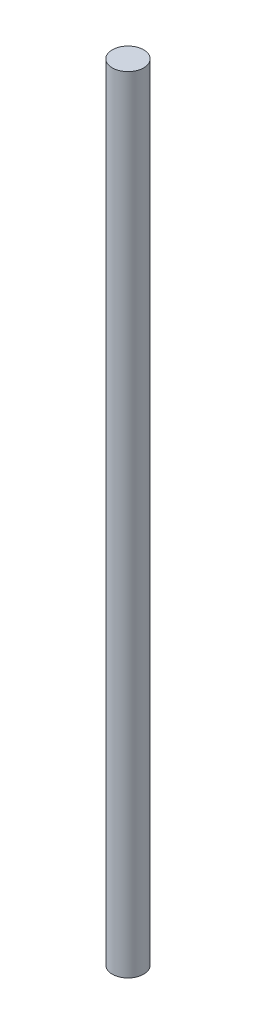
ISO-10303-21;
HEADER;
FILE_DESCRIPTION(('STEP AP214'),'2;1');
FILE_NAME('part.step','',(''),(''),'','','');
FILE_SCHEMA(('AUTOMOTIVE_DESIGN { 1 0 10303 214 1 1 1 1 }'));
ENDSEC;
DATA;
#1=APPLICATION_CONTEXT('core data for automotive mechanical design processes');
#2=APPLICATION_PROTOCOL_DEFINITION('international standard','automotive_design',2000,#1);
#3=PRODUCT_CONTEXT('',#1,'mechanical');
#4=PRODUCT('Part','Part','',(#3));
#5=PRODUCT_RELATED_PRODUCT_CATEGORY('part','',(#4));
#6=PRODUCT_DEFINITION_FORMATION('','',#4);
#7=PRODUCT_DEFINITION_CONTEXT('part definition',#1,'design');
#8=PRODUCT_DEFINITION('design','',#6,#7);
#9=PRODUCT_DEFINITION_SHAPE('','',#8);
#10=(LENGTH_UNIT() NAMED_UNIT(*) SI_UNIT(.MILLI.,.METRE.));
#11=(NAMED_UNIT(*) PLANE_ANGLE_UNIT() SI_UNIT($,.RADIAN.));
#12=(NAMED_UNIT(*) SI_UNIT($,.STERADIAN.) SOLID_ANGLE_UNIT());
#13=UNCERTAINTY_MEASURE_WITH_UNIT(LENGTH_MEASURE(1.E-05),#10,'distance_accuracy_value','');
#14=(GEOMETRIC_REPRESENTATION_CONTEXT(3) GLOBAL_UNCERTAINTY_ASSIGNED_CONTEXT((#13)) GLOBAL_UNIT_ASSIGNED_CONTEXT((#10,
#11,#12)) REPRESENTATION_CONTEXT('',''));
#15=CARTESIAN_POINT('',(0.,0.,0.));
#16=DIRECTION('',(0.,0.,1.));
#17=DIRECTION('',(1.,0.,0.));
#18=AXIS2_PLACEMENT_3D('',#15,#16,#17);
#19=CARTESIAN_POINT('',(0.,200.,0.));
#20=DIRECTION('',(0.,-1.,0.));
#21=DIRECTION('',(0.,0.,-1.));
#22=AXIS2_PLACEMENT_3D('',#19,#20,#21);
#23=CYLINDRICAL_SURFACE('',#22,4.);
#24=CARTESIAN_POINT('',(0.,200.,0.));
#25=DIRECTION('',(0.,1.,0.));
#26=DIRECTION('',(0.,0.,1.));
#27=AXIS2_PLACEMENT_3D('',#24,#25,#26);
#28=CIRCLE('',#27,4.);
#29=CARTESIAN_POINT('',(0.,200.,4.));
#30=VERTEX_POINT('',#29);
#31=EDGE_CURVE('E10',#30,#30,#28,.T.);
#32=ORIENTED_EDGE('',*,*,#31,.F.);
#33=EDGE_LOOP('',(#32));
#34=FACE_BOUND('',#33,.T.);
#35=CARTESIAN_POINT('',(0.,0.,0.));
#36=DIRECTION('',(0.,1.,0.));
#37=DIRECTION('',(0.,0.,1.));
#38=AXIS2_PLACEMENT_3D('',#35,#36,#37);
#39=CIRCLE('',#38,4.);
#40=CARTESIAN_POINT('',(0.,0.,4.));
#41=VERTEX_POINT('',#40);
#42=EDGE_CURVE('E35',#41,#41,#39,.T.);
#43=ORIENTED_EDGE('',*,*,#42,.T.);
#44=EDGE_LOOP('',(#43));
#45=FACE_BOUND('',#44,.T.);
#46=ADVANCED_FACE('F32',(#34,#45),#23,.T.);
#47=CARTESIAN_POINT('',(0.,200.,0.));
#48=DIRECTION('',(0.,1.,0.));
#49=DIRECTION('',(0.,0.,1.));
#50=AXIS2_PLACEMENT_3D('',#47,#48,#49);
#51=PLANE('',#50);
#52=ORIENTED_EDGE('',*,*,#31,.T.);
#53=EDGE_LOOP('',(#52));
#54=FACE_BOUND('',#53,.T.);
#55=ADVANCED_FACE('F47',(#54),#51,.T.);
#56=CARTESIAN_POINT('',(0.,0.,0.));
#57=DIRECTION('',(0.,1.,0.));
#58=DIRECTION('',(0.,0.,1.));
#59=AXIS2_PLACEMENT_3D('',#56,#57,#58);
#60=PLANE('',#59);
#61=ORIENTED_EDGE('',*,*,#42,.F.);
#62=EDGE_LOOP('',(#61));
#63=FACE_BOUND('',#62,.T.);
#64=ADVANCED_FACE('F45',(#63),#60,.F.);
#65=CLOSED_SHELL('',(#46,#55,#64));
#66=MANIFOLD_SOLID_BREP('B2',#65);
#67=ADVANCED_BREP_SHAPE_REPRESENTATION('',(#18,#66),#14);
#68=SHAPE_DEFINITION_REPRESENTATION(#9,#67);
ENDSEC;
END-ISO-10303-21;
